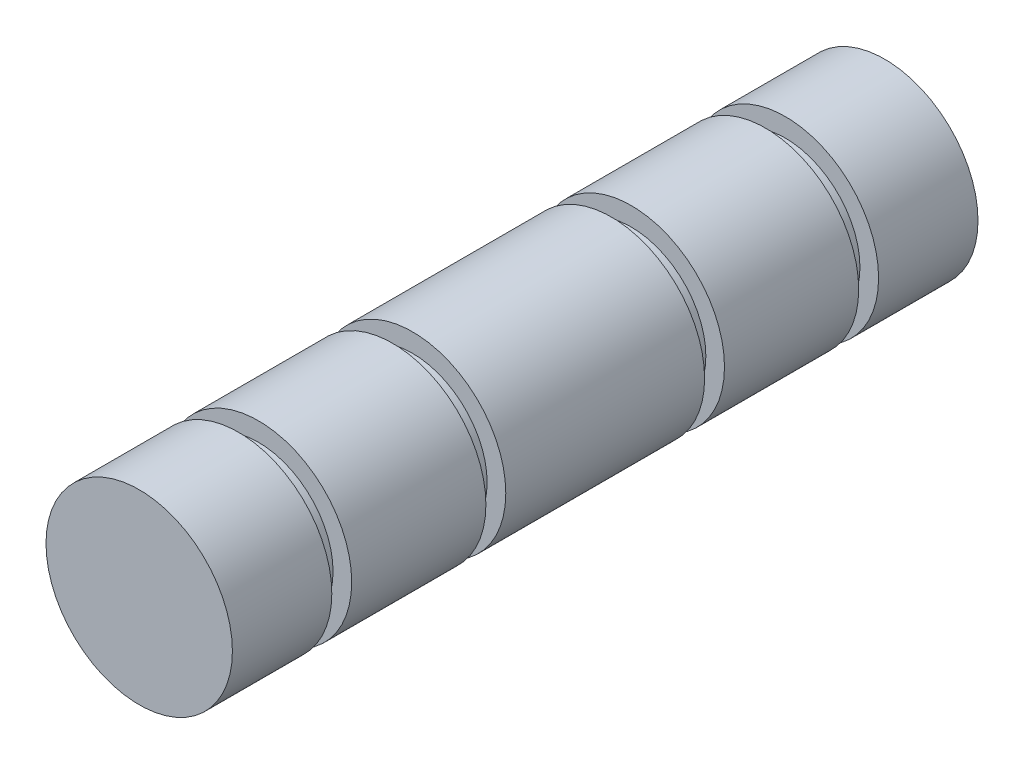
ISO-10303-21;
HEADER;
FILE_DESCRIPTION(('STEP AP214'),'2;1');
FILE_NAME('part.step','',(''),(''),'','','');
FILE_SCHEMA(('AUTOMOTIVE_DESIGN { 1 0 10303 214 1 1 1 1 }'));
ENDSEC;
DATA;
#1=APPLICATION_CONTEXT('core data for automotive mechanical design processes');
#2=APPLICATION_PROTOCOL_DEFINITION('international standard','automotive_design',2000,#1);
#3=PRODUCT_CONTEXT('',#1,'mechanical');
#4=PRODUCT('Part','Part','',(#3));
#5=PRODUCT_RELATED_PRODUCT_CATEGORY('part','',(#4));
#6=PRODUCT_DEFINITION_FORMATION('','',#4);
#7=PRODUCT_DEFINITION_CONTEXT('part definition',#1,'design');
#8=PRODUCT_DEFINITION('design','',#6,#7);
#9=PRODUCT_DEFINITION_SHAPE('','',#8);
#10=(LENGTH_UNIT() NAMED_UNIT(*) SI_UNIT(.MILLI.,.METRE.));
#11=(NAMED_UNIT(*) PLANE_ANGLE_UNIT() SI_UNIT($,.RADIAN.));
#12=(NAMED_UNIT(*) SI_UNIT($,.STERADIAN.) SOLID_ANGLE_UNIT());
#13=UNCERTAINTY_MEASURE_WITH_UNIT(LENGTH_MEASURE(1.E-05),#10,'distance_accuracy_value','');
#14=(GEOMETRIC_REPRESENTATION_CONTEXT(3) GLOBAL_UNCERTAINTY_ASSIGNED_CONTEXT((#13)) GLOBAL_UNIT_ASSIGNED_CONTEXT((#10,
#11,#12)) REPRESENTATION_CONTEXT('',''));
#15=CARTESIAN_POINT('',(0.,0.,0.));
#16=DIRECTION('',(0.,0.,1.));
#17=DIRECTION('',(1.,0.,0.));
#18=AXIS2_PLACEMENT_3D('',#15,#16,#17);
#19=CARTESIAN_POINT('',(0.,0.,19.05));
#20=DIRECTION('',(0.,0.,-1.));
#21=DIRECTION('',(-1.,0.,0.));
#22=AXIS2_PLACEMENT_3D('',#19,#20,#21);
#23=CYLINDRICAL_SURFACE('',#22,4.7625);
#24=CARTESIAN_POINT('',(0.,0.,-13.97));
#25=DIRECTION('',(0.,0.,1.));
#26=DIRECTION('',(1.,0.,0.));
#27=AXIS2_PLACEMENT_3D('',#24,#25,#26);
#28=CIRCLE('',#27,4.7625);
#29=CARTESIAN_POINT('',(4.7625,0.,-13.97));
#30=VERTEX_POINT('',#29);
#31=EDGE_CURVE('E79',#30,#30,#28,.T.);
#32=ORIENTED_EDGE('',*,*,#31,.F.);
#33=EDGE_LOOP('',(#32));
#34=FACE_BOUND('',#33,.T.);
#35=CARTESIAN_POINT('',(0.,0.,-19.05));
#36=DIRECTION('',(0.,0.,1.));
#37=DIRECTION('',(1.,0.,0.));
#38=AXIS2_PLACEMENT_3D('',#35,#36,#37);
#39=CIRCLE('',#38,4.7625);
#40=CARTESIAN_POINT('',(4.7625,0.,-19.05));
#41=VERTEX_POINT('',#40);
#42=EDGE_CURVE('E46',#41,#41,#39,.T.);
#43=ORIENTED_EDGE('',*,*,#42,.T.);
#44=EDGE_LOOP('',(#43));
#45=FACE_BOUND('',#44,.T.);
#46=ADVANCED_FACE('F43',(#34,#45),#23,.T.);
#47=CARTESIAN_POINT('',(0.,0.,-19.05));
#48=DIRECTION('',(0.,0.,1.));
#49=DIRECTION('',(1.,0.,0.));
#50=AXIS2_PLACEMENT_3D('',#47,#48,#49);
#51=PLANE('',#50);
#52=ORIENTED_EDGE('',*,*,#42,.F.);
#53=EDGE_LOOP('',(#52));
#54=FACE_BOUND('',#53,.T.);
#55=ADVANCED_FACE('F125',(#54),#51,.F.);
#56=CARTESIAN_POINT('',(4.7625,0.,-12.954));
#57=DIRECTION('',(0.,0.,1.));
#58=DIRECTION('',(1.,0.,0.));
#59=AXIS2_PLACEMENT_3D('',#56,#57,#58);
#60=PLANE('',#59);
#61=CARTESIAN_POINT('',(0.,0.,-12.954));
#62=DIRECTION('',(0.,0.,1.));
#63=DIRECTION('',(1.,0.,0.));
#64=AXIS2_PLACEMENT_3D('',#61,#62,#63);
#65=CIRCLE('',#64,4.7625);
#66=CARTESIAN_POINT('',(4.7625,0.,-12.954));
#67=VERTEX_POINT('',#66);
#68=EDGE_CURVE('E55',#67,#67,#65,.T.);
#69=ORIENTED_EDGE('',*,*,#68,.F.);
#70=EDGE_LOOP('',(#69));
#71=FACE_BOUND('',#70,.T.);
#72=CARTESIAN_POINT('',(0.,0.,-12.954));
#73=DIRECTION('',(0.,0.,1.));
#74=DIRECTION('',(1.,0.,0.));
#75=AXIS2_PLACEMENT_3D('',#72,#73,#74);
#76=CIRCLE('',#75,3.81);
#77=CARTESIAN_POINT('',(3.81,0.,-12.954));
#78=VERTEX_POINT('',#77);
#79=EDGE_CURVE('E109',#78,#78,#76,.T.);
#80=ORIENTED_EDGE('',*,*,#79,.T.);
#81=EDGE_LOOP('',(#80));
#82=FACE_BOUND('',#81,.T.);
#83=ADVANCED_FACE('F131',(#71,#82),#60,.F.);
#84=CARTESIAN_POINT('',(0.,0.,19.05));
#85=DIRECTION('',(0.,0.,1.));
#86=DIRECTION('',(1.,0.,0.));
#87=AXIS2_PLACEMENT_3D('',#84,#85,#86);
#88=CYLINDRICAL_SURFACE('',#87,3.81);
#89=ORIENTED_EDGE('',*,*,#79,.F.);
#90=EDGE_LOOP('',(#89));
#91=FACE_BOUND('',#90,.T.);
#92=CARTESIAN_POINT('',(0.,0.,-13.97));
#93=DIRECTION('',(0.,0.,1.));
#94=DIRECTION('',(1.,0.,0.));
#95=AXIS2_PLACEMENT_3D('',#92,#93,#94);
#96=CIRCLE('',#95,3.81);
#97=CARTESIAN_POINT('',(3.81,0.,-13.97));
#98=VERTEX_POINT('',#97);
#99=EDGE_CURVE('E113',#98,#98,#96,.T.);
#100=ORIENTED_EDGE('',*,*,#99,.T.);
#101=EDGE_LOOP('',(#100));
#102=FACE_BOUND('',#101,.T.);
#103=ADVANCED_FACE('F136',(#91,#102),#88,.T.);
#104=CARTESIAN_POINT('',(4.7625,0.,-13.97));
#105=DIRECTION('',(0.,0.,-1.));
#106=DIRECTION('',(-1.,0.,0.));
#107=AXIS2_PLACEMENT_3D('',#104,#105,#106);
#108=PLANE('',#107);
#109=ORIENTED_EDGE('',*,*,#99,.F.);
#110=EDGE_LOOP('',(#109));
#111=FACE_BOUND('',#110,.T.);
#112=ORIENTED_EDGE('',*,*,#31,.T.);
#113=EDGE_LOOP('',(#112));
#114=FACE_BOUND('',#113,.T.);
#115=ADVANCED_FACE('F121',(#111,#114),#108,.F.);
#116=ORIENTED_EDGE('',*,*,#68,.T.);
#117=EDGE_LOOP('',(#116));
#118=FACE_BOUND('',#117,.T.);
#119=CARTESIAN_POINT('',(0.,0.,-6.096));
#120=DIRECTION('',(0.,0.,1.));
#121=DIRECTION('',(1.,0.,0.));
#122=AXIS2_PLACEMENT_3D('',#119,#120,#121);
#123=CIRCLE('',#122,4.7625);
#124=CARTESIAN_POINT('',(4.7625,0.,-6.096));
#125=VERTEX_POINT('',#124);
#126=EDGE_CURVE('E70',#125,#125,#123,.T.);
#127=ORIENTED_EDGE('',*,*,#126,.F.);
#128=EDGE_LOOP('',(#127));
#129=FACE_BOUND('',#128,.T.);
#130=ADVANCED_FACE('F126',(#118,#129),#23,.T.);
#131=CARTESIAN_POINT('',(4.7625,0.,-5.08));
#132=DIRECTION('',(0.,0.,1.));
#133=DIRECTION('',(1.,0.,0.));
#134=AXIS2_PLACEMENT_3D('',#131,#132,#133);
#135=PLANE('',#134);
#136=CARTESIAN_POINT('',(0.,0.,-5.08));
#137=DIRECTION('',(0.,0.,1.));
#138=DIRECTION('',(1.,0.,0.));
#139=AXIS2_PLACEMENT_3D('',#136,#137,#138);
#140=CIRCLE('',#139,4.7625);
#141=CARTESIAN_POINT('',(4.7625,0.,-5.08));
#142=VERTEX_POINT('',#141);
#143=EDGE_CURVE('E57',#142,#142,#140,.T.);
#144=ORIENTED_EDGE('',*,*,#143,.F.);
#145=EDGE_LOOP('',(#144));
#146=FACE_BOUND('',#145,.T.);
#147=CARTESIAN_POINT('',(0.,0.,-5.08));
#148=DIRECTION('',(0.,0.,1.));
#149=DIRECTION('',(1.,0.,0.));
#150=AXIS2_PLACEMENT_3D('',#147,#148,#149);
#151=CIRCLE('',#150,3.81);
#152=CARTESIAN_POINT('',(3.81,0.,-5.08));
#153=VERTEX_POINT('',#152);
#154=EDGE_CURVE('E62',#153,#153,#151,.T.);
#155=ORIENTED_EDGE('',*,*,#154,.T.);
#156=EDGE_LOOP('',(#155));
#157=FACE_BOUND('',#156,.T.);
#158=ADVANCED_FACE('F143',(#146,#157),#135,.F.);
#159=CARTESIAN_POINT('',(0.,0.,19.05));
#160=DIRECTION('',(0.,0.,1.));
#161=DIRECTION('',(1.,0.,0.));
#162=AXIS2_PLACEMENT_3D('',#159,#160,#161);
#163=CYLINDRICAL_SURFACE('',#162,3.81);
#164=ORIENTED_EDGE('',*,*,#154,.F.);
#165=EDGE_LOOP('',(#164));
#166=FACE_BOUND('',#165,.T.);
#167=CARTESIAN_POINT('',(0.,0.,-6.096));
#168=DIRECTION('',(0.,0.,1.));
#169=DIRECTION('',(1.,0.,0.));
#170=AXIS2_PLACEMENT_3D('',#167,#168,#169);
#171=CIRCLE('',#170,3.81);
#172=CARTESIAN_POINT('',(3.81,0.,-6.096));
#173=VERTEX_POINT('',#172);
#174=EDGE_CURVE('E66',#173,#173,#171,.T.);
#175=ORIENTED_EDGE('',*,*,#174,.T.);
#176=EDGE_LOOP('',(#175));
#177=FACE_BOUND('',#176,.T.);
#178=ADVANCED_FACE('F146',(#166,#177),#163,.T.);
#179=CARTESIAN_POINT('',(4.7625,0.,-6.096));
#180=DIRECTION('',(0.,0.,-1.));
#181=DIRECTION('',(-1.,0.,0.));
#182=AXIS2_PLACEMENT_3D('',#179,#180,#181);
#183=PLANE('',#182);
#184=ORIENTED_EDGE('',*,*,#174,.F.);
#185=EDGE_LOOP('',(#184));
#186=FACE_BOUND('',#185,.T.);
#187=ORIENTED_EDGE('',*,*,#126,.T.);
#188=EDGE_LOOP('',(#187));
#189=FACE_BOUND('',#188,.T.);
#190=ADVANCED_FACE('F150',(#186,#189),#183,.F.);
#191=CARTESIAN_POINT('',(0.,0.,5.08));
#192=DIRECTION('',(0.,0.,1.));
#193=DIRECTION('',(1.,0.,0.));
#194=AXIS2_PLACEMENT_3D('',#191,#192,#193);
#195=CIRCLE('',#194,4.7625);
#196=CARTESIAN_POINT('',(4.7625,0.,5.08));
#197=VERTEX_POINT('',#196);
#198=EDGE_CURVE('E102',#197,#197,#195,.T.);
#199=ORIENTED_EDGE('',*,*,#198,.F.);
#200=EDGE_LOOP('',(#199));
#201=FACE_BOUND('',#200,.T.);
#202=ORIENTED_EDGE('',*,*,#143,.T.);
#203=EDGE_LOOP('',(#202));
#204=FACE_BOUND('',#203,.T.);
#205=ADVANCED_FACE('F154',(#201,#204),#23,.T.);
#206=CARTESIAN_POINT('',(4.7625,0.,6.096));
#207=DIRECTION('',(0.,0.,1.));
#208=DIRECTION('',(1.,0.,0.));
#209=AXIS2_PLACEMENT_3D('',#206,#207,#208);
#210=PLANE('',#209);
#211=CARTESIAN_POINT('',(0.,0.,6.096));
#212=DIRECTION('',(0.,0.,1.));
#213=DIRECTION('',(1.,0.,0.));
#214=AXIS2_PLACEMENT_3D('',#211,#212,#213);
#215=CIRCLE('',#214,4.7625);
#216=CARTESIAN_POINT('',(4.7625,0.,6.096));
#217=VERTEX_POINT('',#216);
#218=EDGE_CURVE('E74',#217,#217,#215,.T.);
#219=ORIENTED_EDGE('',*,*,#218,.F.);
#220=EDGE_LOOP('',(#219));
#221=FACE_BOUND('',#220,.T.);
#222=CARTESIAN_POINT('',(0.,0.,6.096));
#223=DIRECTION('',(0.,0.,1.));
#224=DIRECTION('',(1.,0.,0.));
#225=AXIS2_PLACEMENT_3D('',#222,#223,#224);
#226=CIRCLE('',#225,3.81);
#227=CARTESIAN_POINT('',(3.81,0.,6.096));
#228=VERTEX_POINT('',#227);
#229=EDGE_CURVE('E94',#228,#228,#226,.T.);
#230=ORIENTED_EDGE('',*,*,#229,.T.);
#231=EDGE_LOOP('',(#230));
#232=FACE_BOUND('',#231,.T.);
#233=ADVANCED_FACE('F168',(#221,#232),#210,.F.);
#234=CARTESIAN_POINT('',(0.,0.,19.05));
#235=DIRECTION('',(0.,0.,1.));
#236=DIRECTION('',(1.,0.,0.));
#237=AXIS2_PLACEMENT_3D('',#234,#235,#236);
#238=CYLINDRICAL_SURFACE('',#237,3.81);
#239=ORIENTED_EDGE('',*,*,#229,.F.);
#240=EDGE_LOOP('',(#239));
#241=FACE_BOUND('',#240,.T.);
#242=CARTESIAN_POINT('',(0.,0.,5.08));
#243=DIRECTION('',(0.,0.,1.));
#244=DIRECTION('',(1.,0.,0.));
#245=AXIS2_PLACEMENT_3D('',#242,#243,#244);
#246=CIRCLE('',#245,3.81);
#247=CARTESIAN_POINT('',(3.81,0.,5.08));
#248=VERTEX_POINT('',#247);
#249=EDGE_CURVE('E98',#248,#248,#246,.T.);
#250=ORIENTED_EDGE('',*,*,#249,.T.);
#251=EDGE_LOOP('',(#250));
#252=FACE_BOUND('',#251,.T.);
#253=ADVANCED_FACE('F171',(#241,#252),#238,.T.);
#254=CARTESIAN_POINT('',(4.7625,0.,5.08));
#255=DIRECTION('',(0.,0.,-1.));
#256=DIRECTION('',(-1.,0.,0.));
#257=AXIS2_PLACEMENT_3D('',#254,#255,#256);
#258=PLANE('',#257);
#259=ORIENTED_EDGE('',*,*,#249,.F.);
#260=EDGE_LOOP('',(#259));
#261=FACE_BOUND('',#260,.T.);
#262=ORIENTED_EDGE('',*,*,#198,.T.);
#263=EDGE_LOOP('',(#262));
#264=FACE_BOUND('',#263,.T.);
#265=ADVANCED_FACE('F175',(#261,#264),#258,.F.);
#266=ORIENTED_EDGE('',*,*,#218,.T.);
#267=EDGE_LOOP('',(#266));
#268=FACE_BOUND('',#267,.T.);
#269=CARTESIAN_POINT('',(0.,0.,12.954));
#270=DIRECTION('',(0.,0.,1.));
#271=DIRECTION('',(1.,0.,0.));
#272=AXIS2_PLACEMENT_3D('',#269,#270,#271);
#273=CIRCLE('',#272,4.7625);
#274=CARTESIAN_POINT('',(4.7625,0.,12.954));
#275=VERTEX_POINT('',#274);
#276=EDGE_CURVE('E61',#275,#275,#273,.T.);
#277=ORIENTED_EDGE('',*,*,#276,.F.);
#278=EDGE_LOOP('',(#277));
#279=FACE_BOUND('',#278,.T.);
#280=ADVANCED_FACE('F160',(#268,#279),#23,.T.);
#281=CARTESIAN_POINT('',(4.7625,0.,13.97));
#282=DIRECTION('',(0.,0.,1.));
#283=DIRECTION('',(1.,0.,0.));
#284=AXIS2_PLACEMENT_3D('',#281,#282,#283);
#285=PLANE('',#284);
#286=CARTESIAN_POINT('',(0.,0.,13.97));
#287=DIRECTION('',(0.,0.,1.));
#288=DIRECTION('',(1.,0.,0.));
#289=AXIS2_PLACEMENT_3D('',#286,#287,#288);
#290=CIRCLE('',#289,4.7625);
#291=CARTESIAN_POINT('',(4.7625,0.,13.97));
#292=VERTEX_POINT('',#291);
#293=EDGE_CURVE('E75',#292,#292,#290,.T.);
#294=ORIENTED_EDGE('',*,*,#293,.F.);
#295=EDGE_LOOP('',(#294));
#296=FACE_BOUND('',#295,.T.);
#297=CARTESIAN_POINT('',(0.,0.,13.97));
#298=DIRECTION('',(0.,0.,1.));
#299=DIRECTION('',(1.,0.,0.));
#300=AXIS2_PLACEMENT_3D('',#297,#298,#299);
#301=CIRCLE('',#300,3.81);
#302=CARTESIAN_POINT('',(3.81,0.,13.97));
#303=VERTEX_POINT('',#302);
#304=EDGE_CURVE('E80',#303,#303,#301,.T.);
#305=ORIENTED_EDGE('',*,*,#304,.T.);
#306=EDGE_LOOP('',(#305));
#307=FACE_BOUND('',#306,.T.);
#308=ADVANCED_FACE('F156',(#296,#307),#285,.F.);
#309=CARTESIAN_POINT('',(0.,0.,19.05));
#310=DIRECTION('',(0.,0.,1.));
#311=DIRECTION('',(1.,0.,0.));
#312=AXIS2_PLACEMENT_3D('',#309,#310,#311);
#313=CYLINDRICAL_SURFACE('',#312,3.81);
#314=ORIENTED_EDGE('',*,*,#304,.F.);
#315=EDGE_LOOP('',(#314));
#316=FACE_BOUND('',#315,.T.);
#317=CARTESIAN_POINT('',(0.,0.,12.954));
#318=DIRECTION('',(0.,0.,1.));
#319=DIRECTION('',(1.,0.,0.));
#320=AXIS2_PLACEMENT_3D('',#317,#318,#319);
#321=CIRCLE('',#320,3.81);
#322=CARTESIAN_POINT('',(3.81,0.,12.954));
#323=VERTEX_POINT('',#322);
#324=EDGE_CURVE('E84',#323,#323,#321,.T.);
#325=ORIENTED_EDGE('',*,*,#324,.T.);
#326=EDGE_LOOP('',(#325));
#327=FACE_BOUND('',#326,.T.);
#328=ADVANCED_FACE('F159',(#316,#327),#313,.T.);
#329=CARTESIAN_POINT('',(4.7625,0.,12.954));
#330=DIRECTION('',(0.,0.,-1.));
#331=DIRECTION('',(-1.,0.,0.));
#332=AXIS2_PLACEMENT_3D('',#329,#330,#331);
#333=PLANE('',#332);
#334=ORIENTED_EDGE('',*,*,#324,.F.);
#335=EDGE_LOOP('',(#334));
#336=FACE_BOUND('',#335,.T.);
#337=ORIENTED_EDGE('',*,*,#276,.T.);
#338=EDGE_LOOP('',(#337));
#339=FACE_BOUND('',#338,.T.);
#340=ADVANCED_FACE('F142',(#336,#339),#333,.F.);
#341=CARTESIAN_POINT('',(0.,0.,19.05));
#342=DIRECTION('',(0.,0.,1.));
#343=DIRECTION('',(1.,0.,0.));
#344=AXIS2_PLACEMENT_3D('',#341,#342,#343);
#345=PLANE('',#344);
#346=CARTESIAN_POINT('',(0.,0.,19.05));
#347=DIRECTION('',(0.,0.,1.));
#348=DIRECTION('',(1.,0.,0.));
#349=AXIS2_PLACEMENT_3D('',#346,#347,#348);
#350=CIRCLE('',#349,4.7625);
#351=CARTESIAN_POINT('',(4.7625,0.,19.05));
#352=VERTEX_POINT('',#351);
#353=EDGE_CURVE('E10',#352,#352,#350,.T.);
#354=ORIENTED_EDGE('',*,*,#353,.T.);
#355=EDGE_LOOP('',(#354));
#356=FACE_BOUND('',#355,.T.);
#357=ADVANCED_FACE('F140',(#356),#345,.T.);
#358=ORIENTED_EDGE('',*,*,#293,.T.);
#359=EDGE_LOOP('',(#358));
#360=FACE_BOUND('',#359,.T.);
#361=ORIENTED_EDGE('',*,*,#353,.F.);
#362=EDGE_LOOP('',(#361));
#363=FACE_BOUND('',#362,.T.);
#364=ADVANCED_FACE('F127',(#360,#363),#23,.T.);
#365=CLOSED_SHELL('',(#46,#55,#83,#103,#115,#130,#158,#178,#190,#205,#233,#253,#265,#280,#308,
#328,#340,#357,#364));
#366=MANIFOLD_SOLID_BREP('B2',#365);
#367=ADVANCED_BREP_SHAPE_REPRESENTATION('',(#18,#366),#14);
#368=SHAPE_DEFINITION_REPRESENTATION(#9,#367);
ENDSEC;
END-ISO-10303-21;
